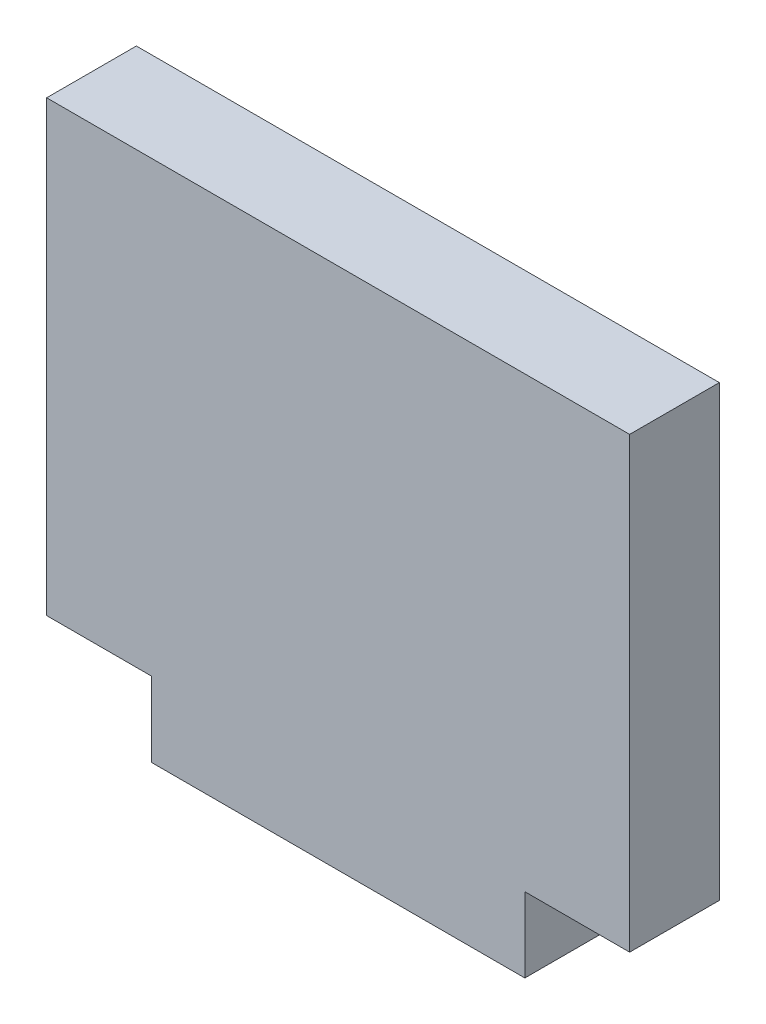
ISO-10303-21;
HEADER;
FILE_DESCRIPTION(('STEP AP214'),'2;1');
FILE_NAME('part.step','',(''),(''),'','','');
FILE_SCHEMA(('AUTOMOTIVE_DESIGN { 1 0 10303 214 1 1 1 1 }'));
ENDSEC;
DATA;
#1=APPLICATION_CONTEXT('core data for automotive mechanical design processes');
#2=APPLICATION_PROTOCOL_DEFINITION('international standard','automotive_design',2000,#1);
#3=PRODUCT_CONTEXT('',#1,'mechanical');
#4=PRODUCT('Part','Part','',(#3));
#5=PRODUCT_RELATED_PRODUCT_CATEGORY('part','',(#4));
#6=PRODUCT_DEFINITION_FORMATION('','',#4);
#7=PRODUCT_DEFINITION_CONTEXT('part definition',#1,'design');
#8=PRODUCT_DEFINITION('design','',#6,#7);
#9=PRODUCT_DEFINITION_SHAPE('','',#8);
#10=(LENGTH_UNIT() NAMED_UNIT(*) SI_UNIT(.MILLI.,.METRE.));
#11=(NAMED_UNIT(*) PLANE_ANGLE_UNIT() SI_UNIT($,.RADIAN.));
#12=(NAMED_UNIT(*) SI_UNIT($,.STERADIAN.) SOLID_ANGLE_UNIT());
#13=UNCERTAINTY_MEASURE_WITH_UNIT(LENGTH_MEASURE(1.E-05),#10,'distance_accuracy_value','');
#14=(GEOMETRIC_REPRESENTATION_CONTEXT(3) GLOBAL_UNCERTAINTY_ASSIGNED_CONTEXT((#13)) GLOBAL_UNIT_ASSIGNED_CONTEXT((#10,
#11,#12)) REPRESENTATION_CONTEXT('',''));
#15=CARTESIAN_POINT('',(0.,0.,0.));
#16=DIRECTION('',(0.,0.,1.));
#17=DIRECTION('',(1.,0.,0.));
#18=AXIS2_PLACEMENT_3D('',#15,#16,#17);
#19=CARTESIAN_POINT('',(20.0433685409747,0.,6.));
#20=DIRECTION('',(1.,0.,0.));
#21=DIRECTION('',(0.,1.,0.));
#22=AXIS2_PLACEMENT_3D('',#19,#20,#21);
#23=PLANE('',#22);
#24=DIRECTION('',(0.,-1.,0.));
#25=VECTOR('',#24,1.);
#26=CARTESIAN_POINT('',(20.0433685409747,0.,0.));
#27=LINE('',#26,#25);
#28=CARTESIAN_POINT('',(20.0433685409747,19.7229752066116,0.));
#29=VERTEX_POINT('',#28);
#30=CARTESIAN_POINT('',(20.0433685409747,-10.2770247933884,0.));
#31=VERTEX_POINT('',#30);
#32=EDGE_CURVE('E128',#29,#31,#27,.T.);
#33=ORIENTED_EDGE('',*,*,#32,.F.);
#34=DIRECTION('',(0.,0.,-1.));
#35=VECTOR('',#34,1.);
#36=CARTESIAN_POINT('',(20.0433685409747,19.7229752066116,6.));
#37=LINE('',#36,#35);
#38=CARTESIAN_POINT('',(20.0433685409747,19.7229752066116,6.));
#39=VERTEX_POINT('',#38);
#40=EDGE_CURVE('E11',#39,#29,#37,.T.);
#41=ORIENTED_EDGE('',*,*,#40,.F.);
#42=DIRECTION('',(0.,-1.,0.));
#43=VECTOR('',#42,1.);
#44=CARTESIAN_POINT('',(20.0433685409747,0.,6.));
#45=LINE('',#44,#43);
#46=CARTESIAN_POINT('',(20.0433685409747,-10.2770247933884,6.));
#47=VERTEX_POINT('',#46);
#48=EDGE_CURVE('E168',#39,#47,#45,.T.);
#49=ORIENTED_EDGE('',*,*,#48,.T.);
#50=DIRECTION('',(0.,0.,-1.));
#51=VECTOR('',#50,1.);
#52=CARTESIAN_POINT('',(20.0433685409747,-10.2770247933884,6.));
#53=LINE('',#52,#51);
#54=EDGE_CURVE('E84',#47,#31,#53,.T.);
#55=ORIENTED_EDGE('',*,*,#54,.T.);
#56=EDGE_LOOP('',(#33,#41,#49,#55));
#57=FACE_BOUND('',#56,.T.);
#58=ADVANCED_FACE('F34',(#57),#23,.T.);
#59=CARTESIAN_POINT('',(0.,19.7229752066116,6.));
#60=DIRECTION('',(0.,1.,0.));
#61=DIRECTION('',(-1.,0.,0.));
#62=AXIS2_PLACEMENT_3D('',#59,#60,#61);
#63=PLANE('',#62);
#64=DIRECTION('',(1.,0.,0.));
#65=VECTOR('',#64,1.);
#66=CARTESIAN_POINT('',(0.,19.7229752066116,0.));
#67=LINE('',#66,#65);
#68=CARTESIAN_POINT('',(-18.9566314590253,19.7229752066116,0.));
#69=VERTEX_POINT('',#68);
#70=EDGE_CURVE('E131',#69,#29,#67,.T.);
#71=ORIENTED_EDGE('',*,*,#70,.F.);
#72=DIRECTION('',(0.,0.,-1.));
#73=VECTOR('',#72,1.);
#74=CARTESIAN_POINT('',(-18.9566314590253,19.7229752066116,6.));
#75=LINE('',#74,#73);
#76=CARTESIAN_POINT('',(-18.9566314590253,19.7229752066116,6.));
#77=VERTEX_POINT('',#76);
#78=EDGE_CURVE('E42',#77,#69,#75,.T.);
#79=ORIENTED_EDGE('',*,*,#78,.F.);
#80=DIRECTION('',(1.,0.,0.));
#81=VECTOR('',#80,1.);
#82=CARTESIAN_POINT('',(0.,19.7229752066116,6.));
#83=LINE('',#82,#81);
#84=EDGE_CURVE('E167',#77,#39,#83,.T.);
#85=ORIENTED_EDGE('',*,*,#84,.T.);
#86=ORIENTED_EDGE('',*,*,#40,.T.);
#87=EDGE_LOOP('',(#71,#79,#85,#86));
#88=FACE_BOUND('',#87,.T.);
#89=ADVANCED_FACE('F166',(#88),#63,.T.);
#90=CARTESIAN_POINT('',(-18.9566314590253,0.,6.));
#91=DIRECTION('',(1.,0.,0.));
#92=DIRECTION('',(0.,1.,0.));
#93=AXIS2_PLACEMENT_3D('',#90,#91,#92);
#94=PLANE('',#93);
#95=DIRECTION('',(0.,-1.,0.));
#96=VECTOR('',#95,1.);
#97=CARTESIAN_POINT('',(-18.9566314590253,0.,0.));
#98=LINE('',#97,#96);
#99=CARTESIAN_POINT('',(-18.9566314590253,-10.2770247933884,0.));
#100=VERTEX_POINT('',#99);
#101=EDGE_CURVE('E134',#69,#100,#98,.T.);
#102=ORIENTED_EDGE('',*,*,#101,.T.);
#103=DIRECTION('',(0.,0.,-1.));
#104=VECTOR('',#103,1.);
#105=CARTESIAN_POINT('',(-18.9566314590253,-10.2770247933884,6.));
#106=LINE('',#105,#104);
#107=CARTESIAN_POINT('',(-18.9566314590253,-10.2770247933884,6.));
#108=VERTEX_POINT('',#107);
#109=EDGE_CURVE('E150',#108,#100,#106,.T.);
#110=ORIENTED_EDGE('',*,*,#109,.F.);
#111=DIRECTION('',(0.,-1.,0.));
#112=VECTOR('',#111,1.);
#113=CARTESIAN_POINT('',(-18.9566314590253,0.,6.));
#114=LINE('',#113,#112);
#115=EDGE_CURVE('E157',#77,#108,#114,.T.);
#116=ORIENTED_EDGE('',*,*,#115,.F.);
#117=ORIENTED_EDGE('',*,*,#78,.T.);
#118=EDGE_LOOP('',(#102,#110,#116,#117));
#119=FACE_BOUND('',#118,.T.);
#120=ADVANCED_FACE('F155',(#119),#94,.F.);
#121=CARTESIAN_POINT('',(0.,-10.2770247933884,6.));
#122=DIRECTION('',(0.,1.,0.));
#123=DIRECTION('',(0.,0.,1.));
#124=AXIS2_PLACEMENT_3D('',#121,#122,#123);
#125=PLANE('',#124);
#126=DIRECTION('',(1.,0.,0.));
#127=VECTOR('',#126,1.);
#128=CARTESIAN_POINT('',(0.,-10.2770247933884,0.));
#129=LINE('',#128,#127);
#130=CARTESIAN_POINT('',(-11.9466314590253,-10.2770247933884,0.));
#131=VERTEX_POINT('',#130);
#132=EDGE_CURVE('E136',#100,#131,#129,.T.);
#133=ORIENTED_EDGE('',*,*,#132,.T.);
#134=DIRECTION('',(0.,0.,-1.));
#135=VECTOR('',#134,1.);
#136=CARTESIAN_POINT('',(-11.9466314590253,-10.2770247933884,6.));
#137=LINE('',#136,#135);
#138=CARTESIAN_POINT('',(-11.9466314590253,-10.2770247933884,6.));
#139=VERTEX_POINT('',#138);
#140=EDGE_CURVE('E147',#139,#131,#137,.T.);
#141=ORIENTED_EDGE('',*,*,#140,.F.);
#142=DIRECTION('',(1.,0.,0.));
#143=VECTOR('',#142,1.);
#144=CARTESIAN_POINT('',(0.,-10.2770247933884,6.));
#145=LINE('',#144,#143);
#146=EDGE_CURVE('E125',#108,#139,#145,.T.);
#147=ORIENTED_EDGE('',*,*,#146,.F.);
#148=ORIENTED_EDGE('',*,*,#109,.T.);
#149=EDGE_LOOP('',(#133,#141,#147,#148));
#150=FACE_BOUND('',#149,.T.);
#151=ADVANCED_FACE('F175',(#150),#125,.F.);
#152=CARTESIAN_POINT('',(-11.9466314590253,0.,6.));
#153=DIRECTION('',(1.,0.,0.));
#154=DIRECTION('',(0.,1.,0.));
#155=AXIS2_PLACEMENT_3D('',#152,#153,#154);
#156=PLANE('',#155);
#157=DIRECTION('',(0.,-1.,0.));
#158=VECTOR('',#157,1.);
#159=CARTESIAN_POINT('',(-11.9466314590253,0.,0.));
#160=LINE('',#159,#158);
#161=CARTESIAN_POINT('',(-11.9466314590253,-15.2770247933884,0.));
#162=VERTEX_POINT('',#161);
#163=EDGE_CURVE('E138',#131,#162,#160,.T.);
#164=ORIENTED_EDGE('',*,*,#163,.T.);
#165=DIRECTION('',(0.,0.,-1.));
#166=VECTOR('',#165,1.);
#167=CARTESIAN_POINT('',(-11.9466314590253,-15.2770247933884,6.));
#168=LINE('',#167,#166);
#169=CARTESIAN_POINT('',(-11.9466314590253,-15.2770247933884,6.));
#170=VERTEX_POINT('',#169);
#171=EDGE_CURVE('E120',#170,#162,#168,.T.);
#172=ORIENTED_EDGE('',*,*,#171,.F.);
#173=DIRECTION('',(0.,-1.,0.));
#174=VECTOR('',#173,1.);
#175=CARTESIAN_POINT('',(-11.9466314590253,0.,6.));
#176=LINE('',#175,#174);
#177=EDGE_CURVE('E107',#139,#170,#176,.T.);
#178=ORIENTED_EDGE('',*,*,#177,.F.);
#179=ORIENTED_EDGE('',*,*,#140,.T.);
#180=EDGE_LOOP('',(#164,#172,#178,#179));
#181=FACE_BOUND('',#180,.T.);
#182=ADVANCED_FACE('F177',(#181),#156,.F.);
#183=CARTESIAN_POINT('',(0.,-15.2770247933884,6.));
#184=DIRECTION('',(0.,1.,0.));
#185=DIRECTION('',(0.,0.,1.));
#186=AXIS2_PLACEMENT_3D('',#183,#184,#185);
#187=PLANE('',#186);
#188=DIRECTION('',(1.,0.,0.));
#189=VECTOR('',#188,1.);
#190=CARTESIAN_POINT('',(0.,-15.2770247933884,0.));
#191=LINE('',#190,#189);
#192=CARTESIAN_POINT('',(13.0333685409747,-15.2770247933884,0.));
#193=VERTEX_POINT('',#192);
#194=EDGE_CURVE('E116',#162,#193,#191,.T.);
#195=ORIENTED_EDGE('',*,*,#194,.T.);
#196=DIRECTION('',(0.,0.,-1.));
#197=VECTOR('',#196,1.);
#198=CARTESIAN_POINT('',(13.0333685409747,-15.2770247933884,6.));
#199=LINE('',#198,#197);
#200=CARTESIAN_POINT('',(13.0333685409747,-15.2770247933884,6.));
#201=VERTEX_POINT('',#200);
#202=EDGE_CURVE('E113',#201,#193,#199,.T.);
#203=ORIENTED_EDGE('',*,*,#202,.F.);
#204=DIRECTION('',(1.,0.,0.));
#205=VECTOR('',#204,1.);
#206=CARTESIAN_POINT('',(0.,-15.2770247933884,6.));
#207=LINE('',#206,#205);
#208=EDGE_CURVE('E101',#170,#201,#207,.T.);
#209=ORIENTED_EDGE('',*,*,#208,.F.);
#210=ORIENTED_EDGE('',*,*,#171,.T.);
#211=EDGE_LOOP('',(#195,#203,#209,#210));
#212=FACE_BOUND('',#211,.T.);
#213=ADVANCED_FACE('F114',(#212),#187,.F.);
#214=CARTESIAN_POINT('',(13.0333685409747,0.,6.));
#215=DIRECTION('',(1.,0.,0.));
#216=DIRECTION('',(0.,1.,0.));
#217=AXIS2_PLACEMENT_3D('',#214,#215,#216);
#218=PLANE('',#217);
#219=DIRECTION('',(0.,-1.,0.));
#220=VECTOR('',#219,1.);
#221=CARTESIAN_POINT('',(13.0333685409747,0.,0.));
#222=LINE('',#221,#220);
#223=CARTESIAN_POINT('',(13.0333685409747,-10.2770247933884,0.));
#224=VERTEX_POINT('',#223);
#225=EDGE_CURVE('E142',#224,#193,#222,.T.);
#226=ORIENTED_EDGE('',*,*,#225,.F.);
#227=DIRECTION('',(0.,0.,-1.));
#228=VECTOR('',#227,1.);
#229=CARTESIAN_POINT('',(13.0333685409747,-10.2770247933884,6.));
#230=LINE('',#229,#228);
#231=CARTESIAN_POINT('',(13.0333685409747,-10.2770247933884,6.));
#232=VERTEX_POINT('',#231);
#233=EDGE_CURVE('E77',#232,#224,#230,.T.);
#234=ORIENTED_EDGE('',*,*,#233,.F.);
#235=DIRECTION('',(0.,-1.,0.));
#236=VECTOR('',#235,1.);
#237=CARTESIAN_POINT('',(13.0333685409747,0.,6.));
#238=LINE('',#237,#236);
#239=EDGE_CURVE('E105',#232,#201,#238,.T.);
#240=ORIENTED_EDGE('',*,*,#239,.T.);
#241=ORIENTED_EDGE('',*,*,#202,.T.);
#242=EDGE_LOOP('',(#226,#234,#240,#241));
#243=FACE_BOUND('',#242,.T.);
#244=ADVANCED_FACE('F122',(#243),#218,.T.);
#245=EDGE_CURVE('E139',#224,#31,#129,.T.);
#246=ORIENTED_EDGE('',*,*,#245,.T.);
#247=ORIENTED_EDGE('',*,*,#54,.F.);
#248=EDGE_CURVE('E50',#232,#47,#145,.T.);
#249=ORIENTED_EDGE('',*,*,#248,.F.);
#250=ORIENTED_EDGE('',*,*,#233,.T.);
#251=EDGE_LOOP('',(#246,#247,#249,#250));
#252=FACE_BOUND('',#251,.T.);
#253=ADVANCED_FACE('F186',(#252),#125,.F.);
#254=CARTESIAN_POINT('',(0.,0.,6.));
#255=DIRECTION('',(0.,0.,1.));
#256=DIRECTION('',(1.,0.,0.));
#257=AXIS2_PLACEMENT_3D('',#254,#255,#256);
#258=PLANE('',#257);
#259=ORIENTED_EDGE('',*,*,#48,.F.);
#260=ORIENTED_EDGE('',*,*,#84,.F.);
#261=ORIENTED_EDGE('',*,*,#115,.T.);
#262=ORIENTED_EDGE('',*,*,#146,.T.);
#263=ORIENTED_EDGE('',*,*,#177,.T.);
#264=ORIENTED_EDGE('',*,*,#208,.T.);
#265=ORIENTED_EDGE('',*,*,#239,.F.);
#266=ORIENTED_EDGE('',*,*,#248,.T.);
#267=EDGE_LOOP('',(#259,#260,#261,#262,#263,#264,#265,#266));
#268=FACE_BOUND('',#267,.T.);
#269=ADVANCED_FACE('F103',(#268),#258,.T.);
#270=CARTESIAN_POINT('',(0.,0.,0.));
#271=DIRECTION('',(0.,0.,1.));
#272=DIRECTION('',(1.,0.,0.));
#273=AXIS2_PLACEMENT_3D('',#270,#271,#272);
#274=PLANE('',#273);
#275=ORIENTED_EDGE('',*,*,#32,.T.);
#276=ORIENTED_EDGE('',*,*,#245,.F.);
#277=ORIENTED_EDGE('',*,*,#225,.T.);
#278=ORIENTED_EDGE('',*,*,#194,.F.);
#279=ORIENTED_EDGE('',*,*,#163,.F.);
#280=ORIENTED_EDGE('',*,*,#132,.F.);
#281=ORIENTED_EDGE('',*,*,#101,.F.);
#282=ORIENTED_EDGE('',*,*,#70,.T.);
#283=EDGE_LOOP('',(#275,#276,#277,#278,#279,#280,#281,#282));
#284=FACE_BOUND('',#283,.T.);
#285=ADVANCED_FACE('F164',(#284),#274,.F.);
#286=CLOSED_SHELL('',(#58,#89,#120,#151,#182,#213,#244,#253,#269,#285));
#287=MANIFOLD_SOLID_BREP('B2',#286);
#288=ADVANCED_BREP_SHAPE_REPRESENTATION('',(#18,#287),#14);
#289=SHAPE_DEFINITION_REPRESENTATION(#9,#288);
ENDSEC;
END-ISO-10303-21;
